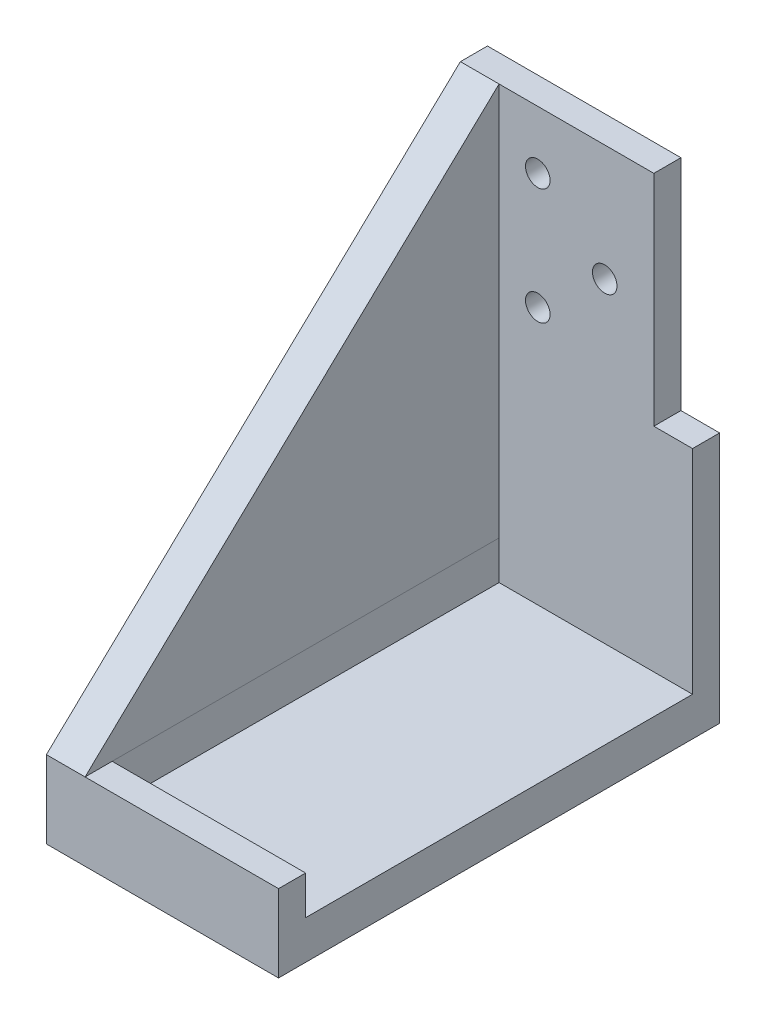
ISO-10303-21;
HEADER;
FILE_DESCRIPTION(('STEP AP214'),'2;1');
FILE_NAME('part.step','',(''),(''),'','','');
FILE_SCHEMA(('AUTOMOTIVE_DESIGN { 1 0 10303 214 1 1 1 1 }'));
ENDSEC;
DATA;
#1=APPLICATION_CONTEXT('core data for automotive mechanical design processes');
#2=APPLICATION_PROTOCOL_DEFINITION('international standard','automotive_design',2000,#1);
#3=PRODUCT_CONTEXT('',#1,'mechanical');
#4=PRODUCT('Part','Part','',(#3));
#5=PRODUCT_RELATED_PRODUCT_CATEGORY('part','',(#4));
#6=PRODUCT_DEFINITION_FORMATION('','',#4);
#7=PRODUCT_DEFINITION_CONTEXT('part definition',#1,'design');
#8=PRODUCT_DEFINITION('design','',#6,#7);
#9=PRODUCT_DEFINITION_SHAPE('','',#8);
#10=(LENGTH_UNIT() NAMED_UNIT(*) SI_UNIT(.MILLI.,.METRE.));
#11=(NAMED_UNIT(*) PLANE_ANGLE_UNIT() SI_UNIT($,.RADIAN.));
#12=(NAMED_UNIT(*) SI_UNIT($,.STERADIAN.) SOLID_ANGLE_UNIT());
#13=UNCERTAINTY_MEASURE_WITH_UNIT(LENGTH_MEASURE(1.E-05),#10,'distance_accuracy_value','');
#14=(GEOMETRIC_REPRESENTATION_CONTEXT(3) GLOBAL_UNCERTAINTY_ASSIGNED_CONTEXT((#13)) GLOBAL_UNIT_ASSIGNED_CONTEXT((#10,
#11,#12)) REPRESENTATION_CONTEXT('',''));
#15=CARTESIAN_POINT('',(0.,0.,0.));
#16=DIRECTION('',(0.,0.,1.));
#17=DIRECTION('',(1.,0.,0.));
#18=AXIS2_PLACEMENT_3D('',#15,#16,#17);
#19=CARTESIAN_POINT('',(30.,177.006953242156,-50.));
#20=DIRECTION('',(0.,0.,-1.));
#21=DIRECTION('',(-1.,0.,0.));
#22=AXIS2_PLACEMENT_3D('',#19,#20,#21);
#23=PLANE('',#22);
#24=CARTESIAN_POINT('',(-10.,96.5999999999998,-50.));
#25=DIRECTION('',(0.,0.,1.));
#26=DIRECTION('',(1.,0.,0.));
#27=AXIS2_PLACEMENT_3D('',#24,#25,#26);
#28=CIRCLE('',#27,3.175);
#29=CARTESIAN_POINT('',(-6.82500000000001,96.5999999999998,-50.));
#30=VERTEX_POINT('',#29);
#31=EDGE_CURVE('E238',#30,#30,#28,.T.);
#32=ORIENTED_EDGE('',*,*,#31,.F.);
#33=EDGE_LOOP('',(#32));
#34=FACE_BOUND('',#33,.T.);
#35=CARTESIAN_POINT('',(7.30000000000001,81.5999999999998,-50.));
#36=DIRECTION('',(0.,0.,1.));
#37=DIRECTION('',(1.,0.,0.));
#38=AXIS2_PLACEMENT_3D('',#35,#36,#37);
#39=CIRCLE('',#38,3.175);
#40=CARTESIAN_POINT('',(10.475,81.5999999999998,-50.));
#41=VERTEX_POINT('',#40);
#42=EDGE_CURVE('E458',#41,#41,#39,.T.);
#43=ORIENTED_EDGE('',*,*,#42,.F.);
#44=EDGE_LOOP('',(#43));
#45=FACE_BOUND('',#44,.T.);
#46=CARTESIAN_POINT('',(-10.,66.5999999999998,-50.));
#47=DIRECTION('',(0.,0.,1.));
#48=DIRECTION('',(1.,0.,0.));
#49=AXIS2_PLACEMENT_3D('',#46,#47,#48);
#50=CIRCLE('',#49,3.175);
#51=CARTESIAN_POINT('',(-6.82500000000001,66.5999999999998,-50.));
#52=VERTEX_POINT('',#51);
#53=EDGE_CURVE('E241',#52,#52,#50,.T.);
#54=ORIENTED_EDGE('',*,*,#53,.F.);
#55=EDGE_LOOP('',(#54));
#56=FACE_BOUND('',#55,.T.);
#57=DIRECTION('',(0.,-1.,0.));
#58=VECTOR('',#57,1.);
#59=CARTESIAN_POINT('',(30.,177.006953242156,-50.));
#60=LINE('',#59,#58);
#61=CARTESIAN_POINT('',(30.,54.9999999999992,-50.));
#62=VERTEX_POINT('',#61);
#63=CARTESIAN_POINT('',(30.,0.,-50.));
#64=VERTEX_POINT('',#63);
#65=EDGE_CURVE('E198',#62,#64,#60,.T.);
#66=ORIENTED_EDGE('',*,*,#65,.F.);
#67=DIRECTION('',(1.,0.,0.));
#68=VECTOR('',#67,1.);
#69=CARTESIAN_POINT('',(30.,54.9999999999992,-50.));
#70=LINE('',#69,#68);
#71=CARTESIAN_POINT('',(20.,54.9999999999992,-50.));
#72=VERTEX_POINT('',#71);
#73=EDGE_CURVE('E245',#72,#62,#70,.T.);
#74=ORIENTED_EDGE('',*,*,#73,.F.);
#75=DIRECTION('',(0.,1.,0.));
#76=VECTOR('',#75,1.);
#77=CARTESIAN_POINT('',(20.,42.7934443842655,-50.));
#78=LINE('',#77,#76);
#79=CARTESIAN_POINT('',(20.,111.6,-50.));
#80=VERTEX_POINT('',#79);
#81=EDGE_CURVE('E128',#72,#80,#78,.T.);
#82=ORIENTED_EDGE('',*,*,#81,.T.);
#83=DIRECTION('',(-1.,0.,0.));
#84=VECTOR('',#83,1.);
#85=CARTESIAN_POINT('',(30.,111.6,-50.));
#86=LINE('',#85,#84);
#87=CARTESIAN_POINT('',(-20.,111.6,-50.));
#88=VERTEX_POINT('',#87);
#89=EDGE_CURVE('E60',#80,#88,#86,.T.);
#90=ORIENTED_EDGE('',*,*,#89,.T.);
#91=DIRECTION('',(0.,1.,0.));
#92=VECTOR('',#91,1.);
#93=CARTESIAN_POINT('',(-20.,177.006953242156,-50.));
#94=LINE('',#93,#92);
#95=CARTESIAN_POINT('',(-20.,10.,-50.));
#96=VERTEX_POINT('',#95);
#97=EDGE_CURVE('E160',#96,#88,#94,.T.);
#98=ORIENTED_EDGE('',*,*,#97,.F.);
#99=DIRECTION('',(0.,-1.,0.));
#100=VECTOR('',#99,1.);
#101=CARTESIAN_POINT('',(-20.,10.,-50.));
#102=LINE('',#101,#100);
#103=CARTESIAN_POINT('',(-20.,0.,-50.));
#104=VERTEX_POINT('',#103);
#105=EDGE_CURVE('E177',#96,#104,#102,.T.);
#106=ORIENTED_EDGE('',*,*,#105,.T.);
#107=DIRECTION('',(1.,0.,0.));
#108=VECTOR('',#107,1.);
#109=CARTESIAN_POINT('',(30.,0.,-50.));
#110=LINE('',#109,#108);
#111=EDGE_CURVE('E190',#104,#64,#110,.T.);
#112=ORIENTED_EDGE('',*,*,#111,.T.);
#113=EDGE_LOOP('',(#66,#74,#82,#90,#98,#106,#112));
#114=FACE_BOUND('',#113,.T.);
#115=ADVANCED_FACE('F37',(#34,#45,#56,#114),#23,.F.);
#116=CARTESIAN_POINT('',(0.,10.,0.));
#117=DIRECTION('',(0.,-1.,0.));
#118=DIRECTION('',(0.,0.,-1.));
#119=AXIS2_PLACEMENT_3D('',#116,#117,#118);
#120=PLANE('',#119);
#121=DIRECTION('',(0.,0.,-1.));
#122=VECTOR('',#121,1.);
#123=CARTESIAN_POINT('',(-20.,10.,0.));
#124=LINE('',#123,#122);
#125=CARTESIAN_POINT('',(-20.,10.,57.));
#126=VERTEX_POINT('',#125);
#127=CARTESIAN_POINT('',(-20.,10.,50.));
#128=VERTEX_POINT('',#127);
#129=EDGE_CURVE('E11',#126,#128,#124,.T.);
#130=ORIENTED_EDGE('',*,*,#129,.F.);
#131=DIRECTION('',(1.,0.,0.));
#132=VECTOR('',#131,1.);
#133=CARTESIAN_POINT('',(30.,10.,57.));
#134=LINE('',#133,#132);
#135=CARTESIAN_POINT('',(30.,10.,57.));
#136=VERTEX_POINT('',#135);
#137=EDGE_CURVE('E168',#126,#136,#134,.T.);
#138=ORIENTED_EDGE('',*,*,#137,.T.);
#139=DIRECTION('',(0.,0.,-1.));
#140=VECTOR('',#139,1.);
#141=CARTESIAN_POINT('',(30.,10.,49.9999999999999));
#142=LINE('',#141,#140);
#143=CARTESIAN_POINT('',(30.,10.,49.9999999999999));
#144=VERTEX_POINT('',#143);
#145=EDGE_CURVE('E167',#136,#144,#142,.T.);
#146=ORIENTED_EDGE('',*,*,#145,.T.);
#147=DIRECTION('',(-1.,0.,0.));
#148=VECTOR('',#147,1.);
#149=CARTESIAN_POINT('',(-20.103587148534,10.,50.));
#150=LINE('',#149,#148);
#151=EDGE_CURVE('E171',#144,#128,#150,.T.);
#152=ORIENTED_EDGE('',*,*,#151,.T.);
#153=EDGE_LOOP('',(#130,#138,#146,#152));
#154=FACE_BOUND('',#153,.T.);
#155=ADVANCED_FACE('F263',(#154),#120,.F.);
#156=CARTESIAN_POINT('',(0.,0.,0.));
#157=DIRECTION('',(0.,-1.,0.));
#158=DIRECTION('',(0.,0.,-1.));
#159=AXIS2_PLACEMENT_3D('',#156,#157,#158);
#160=PLANE('',#159);
#161=DIRECTION('',(-1.,0.,0.));
#162=VECTOR('',#161,1.);
#163=CARTESIAN_POINT('',(-20.103587148534,0.,50.));
#164=LINE('',#163,#162);
#165=CARTESIAN_POINT('',(30.,0.,50.));
#166=VERTEX_POINT('',#165);
#167=CARTESIAN_POINT('',(-20.103587148534,0.,50.));
#168=VERTEX_POINT('',#167);
#169=EDGE_CURVE('E163',#166,#168,#164,.T.);
#170=ORIENTED_EDGE('',*,*,#169,.F.);
#171=DIRECTION('',(0.,0.,-1.));
#172=VECTOR('',#171,1.);
#173=CARTESIAN_POINT('',(30.,0.,57.));
#174=LINE('',#173,#172);
#175=EDGE_CURVE('E195',#166,#64,#174,.T.);
#176=ORIENTED_EDGE('',*,*,#175,.T.);
#177=ORIENTED_EDGE('',*,*,#111,.F.);
#178=DIRECTION('',(0.00103587092957979,0.,-0.999999463485565));
#179=VECTOR('',#178,1.);
#180=CARTESIAN_POINT('',(-20.,0.,-50.));
#181=LINE('',#180,#179);
#182=EDGE_CURVE('E180',#168,#104,#181,.T.);
#183=ORIENTED_EDGE('',*,*,#182,.F.);
#184=EDGE_LOOP('',(#170,#176,#177,#183));
#185=FACE_BOUND('',#184,.T.);
#186=ADVANCED_FACE('F250',(#185),#160,.F.);
#187=CARTESIAN_POINT('',(30.,-10.,57.));
#188=DIRECTION('',(1.,0.,0.));
#189=DIRECTION('',(0.,0.,-1.));
#190=AXIS2_PLACEMENT_3D('',#187,#188,#189);
#191=PLANE('',#190);
#192=DIRECTION('',(0.,0.,-1.));
#193=VECTOR('',#192,1.);
#194=CARTESIAN_POINT('',(30.,54.9999999999991,-57.));
#195=LINE('',#194,#193);
#196=CARTESIAN_POINT('',(30.,54.9999999999991,-57.));
#197=VERTEX_POINT('',#196);
#198=EDGE_CURVE('E136',#62,#197,#195,.T.);
#199=ORIENTED_EDGE('',*,*,#198,.F.);
#200=ORIENTED_EDGE('',*,*,#65,.T.);
#201=ORIENTED_EDGE('',*,*,#175,.F.);
#202=DIRECTION('',(0.,-1.,0.));
#203=VECTOR('',#202,1.);
#204=CARTESIAN_POINT('',(30.,10.,49.9999999999999));
#205=LINE('',#204,#203);
#206=EDGE_CURVE('E187',#144,#166,#205,.T.);
#207=ORIENTED_EDGE('',*,*,#206,.F.);
#208=ORIENTED_EDGE('',*,*,#145,.F.);
#209=DIRECTION('',(0.,1.,0.));
#210=VECTOR('',#209,1.);
#211=CARTESIAN_POINT('',(30.,-10.,57.));
#212=LINE('',#211,#210);
#213=CARTESIAN_POINT('',(30.,-10.,57.));
#214=VERTEX_POINT('',#213);
#215=EDGE_CURVE('E45',#214,#136,#212,.T.);
#216=ORIENTED_EDGE('',*,*,#215,.F.);
#217=DIRECTION('',(0.,0.,-1.));
#218=VECTOR('',#217,1.);
#219=CARTESIAN_POINT('',(30.,-10.,57.));
#220=LINE('',#219,#218);
#221=CARTESIAN_POINT('',(30.,-10.,-57.));
#222=VERTEX_POINT('',#221);
#223=EDGE_CURVE('E201',#214,#222,#220,.T.);
#224=ORIENTED_EDGE('',*,*,#223,.T.);
#225=DIRECTION('',(0.,1.,0.));
#226=VECTOR('',#225,1.);
#227=CARTESIAN_POINT('',(30.,-10.,-57.));
#228=LINE('',#227,#226);
#229=EDGE_CURVE('E213',#222,#197,#228,.T.);
#230=ORIENTED_EDGE('',*,*,#229,.T.);
#231=EDGE_LOOP('',(#199,#200,#201,#207,#208,#216,#224,#230));
#232=FACE_BOUND('',#231,.T.);
#233=ADVANCED_FACE('F39',(#232),#191,.T.);
#234=CARTESIAN_POINT('',(-30.,-10.,57.));
#235=DIRECTION('',(0.,0.,1.));
#236=DIRECTION('',(1.,0.,0.));
#237=AXIS2_PLACEMENT_3D('',#234,#235,#236);
#238=PLANE('',#237);
#239=ORIENTED_EDGE('',*,*,#215,.T.);
#240=ORIENTED_EDGE('',*,*,#137,.F.);
#241=CARTESIAN_POINT('',(-30.,10.,57.));
#242=VERTEX_POINT('',#241);
#243=EDGE_CURVE('E164',#242,#126,#134,.T.);
#244=ORIENTED_EDGE('',*,*,#243,.F.);
#245=DIRECTION('',(0.,1.,0.));
#246=VECTOR('',#245,1.);
#247=CARTESIAN_POINT('',(-30.,-10.,57.));
#248=LINE('',#247,#246);
#249=CARTESIAN_POINT('',(-30.,-10.,57.));
#250=VERTEX_POINT('',#249);
#251=EDGE_CURVE('E218',#250,#242,#248,.T.);
#252=ORIENTED_EDGE('',*,*,#251,.F.);
#253=DIRECTION('',(1.,0.,0.));
#254=VECTOR('',#253,1.);
#255=CARTESIAN_POINT('',(-30.,-10.,57.));
#256=LINE('',#255,#254);
#257=EDGE_CURVE('E210',#250,#214,#256,.T.);
#258=ORIENTED_EDGE('',*,*,#257,.T.);
#259=EDGE_LOOP('',(#239,#240,#244,#252,#258));
#260=FACE_BOUND('',#259,.T.);
#261=ADVANCED_FACE('F272',(#260),#238,.T.);
#262=CARTESIAN_POINT('',(-30.,-10.,57.));
#263=DIRECTION('',(-1.,0.,0.));
#264=DIRECTION('',(0.,0.,1.));
#265=AXIS2_PLACEMENT_3D('',#262,#263,#264);
#266=PLANE('',#265);
#267=DIRECTION('',(0.,0.688571326100926,-0.725168620992119));
#268=VECTOR('',#267,1.);
#269=CARTESIAN_POINT('',(-30.,10.,57.));
#270=LINE('',#269,#268);
#271=CARTESIAN_POINT('',(-30.,111.6,-50.));
#272=VERTEX_POINT('',#271);
#273=EDGE_CURVE('E152',#242,#272,#270,.T.);
#274=ORIENTED_EDGE('',*,*,#273,.T.);
#275=DIRECTION('',(0.,0.,-1.));
#276=VECTOR('',#275,1.);
#277=CARTESIAN_POINT('',(-30.,111.6,-50.));
#278=LINE('',#277,#276);
#279=CARTESIAN_POINT('',(-30.,111.6,-57.));
#280=VERTEX_POINT('',#279);
#281=EDGE_CURVE('E191',#272,#280,#278,.T.);
#282=ORIENTED_EDGE('',*,*,#281,.T.);
#283=DIRECTION('',(0.,1.,0.));
#284=VECTOR('',#283,1.);
#285=CARTESIAN_POINT('',(-30.,-10.,-57.));
#286=LINE('',#285,#284);
#287=CARTESIAN_POINT('',(-30.,-10.,-57.));
#288=VERTEX_POINT('',#287);
#289=EDGE_CURVE('E221',#288,#280,#286,.T.);
#290=ORIENTED_EDGE('',*,*,#289,.F.);
#291=DIRECTION('',(0.,0.,1.));
#292=VECTOR('',#291,1.);
#293=CARTESIAN_POINT('',(-30.,-10.,57.));
#294=LINE('',#293,#292);
#295=EDGE_CURVE('E207',#288,#250,#294,.T.);
#296=ORIENTED_EDGE('',*,*,#295,.T.);
#297=ORIENTED_EDGE('',*,*,#251,.T.);
#298=EDGE_LOOP('',(#274,#282,#290,#296,#297));
#299=FACE_BOUND('',#298,.T.);
#300=ADVANCED_FACE('F231',(#299),#266,.T.);
#301=CARTESIAN_POINT('',(-30.,-10.,-57.));
#302=DIRECTION('',(0.,0.,-1.));
#303=DIRECTION('',(-1.,0.,0.));
#304=AXIS2_PLACEMENT_3D('',#301,#302,#303);
#305=PLANE('',#304);
#306=CARTESIAN_POINT('',(-10.,96.5999999999998,-57.));
#307=DIRECTION('',(0.,0.,1.));
#308=DIRECTION('',(1.,0.,0.));
#309=AXIS2_PLACEMENT_3D('',#306,#307,#308);
#310=CIRCLE('',#309,3.175);
#311=CARTESIAN_POINT('',(-6.82500000000001,96.5999999999998,-57.));
#312=VERTEX_POINT('',#311);
#313=EDGE_CURVE('E235',#312,#312,#310,.T.);
#314=ORIENTED_EDGE('',*,*,#313,.T.);
#315=EDGE_LOOP('',(#314));
#316=FACE_BOUND('',#315,.T.);
#317=CARTESIAN_POINT('',(7.30000000000001,81.5999999999998,-57.));
#318=DIRECTION('',(0.,0.,1.));
#319=DIRECTION('',(1.,0.,0.));
#320=AXIS2_PLACEMENT_3D('',#317,#318,#319);
#321=CIRCLE('',#320,3.175);
#322=CARTESIAN_POINT('',(10.475,81.5999999999998,-57.));
#323=VERTEX_POINT('',#322);
#324=EDGE_CURVE('E455',#323,#323,#321,.T.);
#325=ORIENTED_EDGE('',*,*,#324,.T.);
#326=EDGE_LOOP('',(#325));
#327=FACE_BOUND('',#326,.T.);
#328=CARTESIAN_POINT('',(-10.,66.5999999999998,-57.));
#329=DIRECTION('',(0.,0.,1.));
#330=DIRECTION('',(1.,0.,0.));
#331=AXIS2_PLACEMENT_3D('',#328,#329,#330);
#332=CIRCLE('',#331,3.175);
#333=CARTESIAN_POINT('',(-6.82500000000001,66.5999999999998,-57.));
#334=VERTEX_POINT('',#333);
#335=EDGE_CURVE('E462',#334,#334,#332,.T.);
#336=ORIENTED_EDGE('',*,*,#335,.T.);
#337=EDGE_LOOP('',(#336));
#338=FACE_BOUND('',#337,.T.);
#339=DIRECTION('',(-1.,0.,0.));
#340=VECTOR('',#339,1.);
#341=CARTESIAN_POINT('',(30.,54.9999999999991,-57.));
#342=LINE('',#341,#340);
#343=CARTESIAN_POINT('',(20.,54.9999999999991,-57.));
#344=VERTEX_POINT('',#343);
#345=EDGE_CURVE('E133',#197,#344,#342,.T.);
#346=ORIENTED_EDGE('',*,*,#345,.F.);
#347=ORIENTED_EDGE('',*,*,#229,.F.);
#348=DIRECTION('',(-1.,0.,0.));
#349=VECTOR('',#348,1.);
#350=CARTESIAN_POINT('',(-30.,-10.,-57.));
#351=LINE('',#350,#349);
#352=EDGE_CURVE('E204',#222,#288,#351,.T.);
#353=ORIENTED_EDGE('',*,*,#352,.T.);
#354=ORIENTED_EDGE('',*,*,#289,.T.);
#355=DIRECTION('',(1.,0.,0.));
#356=VECTOR('',#355,1.);
#357=CARTESIAN_POINT('',(-30.,111.6,-57.));
#358=LINE('',#357,#356);
#359=CARTESIAN_POINT('',(20.,111.6,-57.));
#360=VERTEX_POINT('',#359);
#361=EDGE_CURVE('E144',#280,#360,#358,.T.);
#362=ORIENTED_EDGE('',*,*,#361,.T.);
#363=DIRECTION('',(0.,1.,0.));
#364=VECTOR('',#363,1.);
#365=CARTESIAN_POINT('',(20.,42.7934443842655,-57.));
#366=LINE('',#365,#364);
#367=EDGE_CURVE('E52',#344,#360,#366,.T.);
#368=ORIENTED_EDGE('',*,*,#367,.F.);
#369=EDGE_LOOP('',(#346,#347,#353,#354,#362,#368));
#370=FACE_BOUND('',#369,.T.);
#371=ADVANCED_FACE('F142',(#316,#327,#338,#370),#305,.T.);
#372=CARTESIAN_POINT('',(0.,-10.,0.));
#373=DIRECTION('',(0.,-1.,0.));
#374=DIRECTION('',(0.,0.,-1.));
#375=AXIS2_PLACEMENT_3D('',#372,#373,#374);
#376=PLANE('',#375);
#377=ORIENTED_EDGE('',*,*,#223,.F.);
#378=ORIENTED_EDGE('',*,*,#257,.F.);
#379=ORIENTED_EDGE('',*,*,#295,.F.);
#380=ORIENTED_EDGE('',*,*,#352,.F.);
#381=EDGE_LOOP('',(#377,#378,#379,#380));
#382=FACE_BOUND('',#381,.T.);
#383=ADVANCED_FACE('F228',(#382),#376,.T.);
#384=CARTESIAN_POINT('',(525.983999999993,111.6,-64.9999999999988));
#385=DIRECTION('',(0.,-1.,0.));
#386=DIRECTION('',(1.,0.,0.));
#387=AXIS2_PLACEMENT_3D('',#384,#385,#386);
#388=PLANE('',#387);
#389=ORIENTED_EDGE('',*,*,#89,.F.);
#390=DIRECTION('',(0.,0.,1.));
#391=VECTOR('',#390,1.);
#392=CARTESIAN_POINT('',(20.,111.6,-57.));
#393=LINE('',#392,#391);
#394=EDGE_CURVE('E139',#360,#80,#393,.T.);
#395=ORIENTED_EDGE('',*,*,#394,.F.);
#396=ORIENTED_EDGE('',*,*,#361,.F.);
#397=ORIENTED_EDGE('',*,*,#281,.F.);
#398=DIRECTION('',(-1.,0.,0.));
#399=VECTOR('',#398,1.);
#400=CARTESIAN_POINT('',(-20.,111.6,-50.));
#401=LINE('',#400,#399);
#402=EDGE_CURVE('E155',#88,#272,#401,.T.);
#403=ORIENTED_EDGE('',*,*,#402,.F.);
#404=EDGE_LOOP('',(#389,#395,#396,#397,#403));
#405=FACE_BOUND('',#404,.T.);
#406=ADVANCED_FACE('F234',(#405),#388,.F.);
#407=CARTESIAN_POINT('',(-20.103587148534,10.,50.));
#408=DIRECTION('',(0.,0.,1.));
#409=DIRECTION('',(1.,0.,0.));
#410=AXIS2_PLACEMENT_3D('',#407,#408,#409);
#411=PLANE('',#410);
#412=ORIENTED_EDGE('',*,*,#169,.T.);
#413=DIRECTION('',(0.,-1.,0.));
#414=VECTOR('',#413,1.);
#415=CARTESIAN_POINT('',(-20.103587148534,10.,50.));
#416=LINE('',#415,#414);
#417=CARTESIAN_POINT('',(-20.103587148534,10.,50.));
#418=VERTEX_POINT('',#417);
#419=EDGE_CURVE('E184',#418,#168,#416,.T.);
#420=ORIENTED_EDGE('',*,*,#419,.F.);
#421=EDGE_CURVE('E170',#128,#418,#150,.T.);
#422=ORIENTED_EDGE('',*,*,#421,.F.);
#423=ORIENTED_EDGE('',*,*,#151,.F.);
#424=ORIENTED_EDGE('',*,*,#206,.T.);
#425=EDGE_LOOP('',(#412,#420,#422,#423,#424));
#426=FACE_BOUND('',#425,.T.);
#427=ADVANCED_FACE('F252',(#426),#411,.F.);
#428=CARTESIAN_POINT('',(-20.,10.,-50.));
#429=DIRECTION('',(-0.999999463485565,0.,-0.00103587092957979));
#430=DIRECTION('',(-0.00103587092957979,0.,0.999999463485565));
#431=AXIS2_PLACEMENT_3D('',#428,#429,#430);
#432=PLANE('',#431);
#433=ORIENTED_EDGE('',*,*,#182,.T.);
#434=ORIENTED_EDGE('',*,*,#105,.F.);
#435=DIRECTION('',(0.00103587092957979,0.,-0.999999463485565));
#436=VECTOR('',#435,1.);
#437=CARTESIAN_POINT('',(-20.,10.,-50.));
#438=LINE('',#437,#436);
#439=EDGE_CURVE('E174',#418,#96,#438,.T.);
#440=ORIENTED_EDGE('',*,*,#439,.F.);
#441=ORIENTED_EDGE('',*,*,#419,.T.);
#442=EDGE_LOOP('',(#433,#434,#440,#441));
#443=FACE_BOUND('',#442,.T.);
#444=ADVANCED_FACE('F256',(#443),#432,.F.);
#445=CARTESIAN_POINT('',(-20.,9.99999999999999,-57.));
#446=DIRECTION('',(0.,-1.,0.));
#447=DIRECTION('',(0.,0.,-1.));
#448=AXIS2_PLACEMENT_3D('',#445,#446,#447);
#449=PLANE('',#448);
#450=ORIENTED_EDGE('',*,*,#421,.T.);
#451=ORIENTED_EDGE('',*,*,#439,.T.);
#452=DIRECTION('',(0.,0.,1.));
#453=VECTOR('',#452,1.);
#454=CARTESIAN_POINT('',(-20.,9.99999999999999,-57.));
#455=LINE('',#454,#453);
#456=EDGE_CURVE('E148',#96,#128,#455,.T.);
#457=ORIENTED_EDGE('',*,*,#456,.T.);
#458=EDGE_LOOP('',(#450,#451,#457));
#459=FACE_BOUND('',#458,.T.);
#460=ADVANCED_FACE('F261',(#459),#449,.T.);
#461=CARTESIAN_POINT('',(-20.,0.,0.));
#462=DIRECTION('',(-1.,0.,0.));
#463=DIRECTION('',(0.,0.,1.));
#464=AXIS2_PLACEMENT_3D('',#461,#462,#463);
#465=PLANE('',#464);
#466=ORIENTED_EDGE('',*,*,#456,.F.);
#467=ORIENTED_EDGE('',*,*,#97,.T.);
#468=DIRECTION('',(0.,0.688571326100926,-0.725168620992119));
#469=VECTOR('',#468,1.);
#470=CARTESIAN_POINT('',(-20.,10.,57.));
#471=LINE('',#470,#469);
#472=EDGE_CURVE('E151',#126,#88,#471,.T.);
#473=ORIENTED_EDGE('',*,*,#472,.F.);
#474=ORIENTED_EDGE('',*,*,#129,.T.);
#475=EDGE_LOOP('',(#466,#467,#473,#474));
#476=FACE_BOUND('',#475,.T.);
#477=ADVANCED_FACE('F268',(#476),#465,.F.);
#478=CARTESIAN_POINT('',(-20.,10.,57.));
#479=DIRECTION('',(0.,0.725168620992119,0.688571326100926));
#480=DIRECTION('',(0.,-0.688571326100927,0.725168620992119));
#481=AXIS2_PLACEMENT_3D('',#478,#479,#480);
#482=PLANE('',#481);
#483=ORIENTED_EDGE('',*,*,#273,.F.);
#484=ORIENTED_EDGE('',*,*,#243,.T.);
#485=ORIENTED_EDGE('',*,*,#472,.T.);
#486=ORIENTED_EDGE('',*,*,#402,.T.);
#487=EDGE_LOOP('',(#483,#484,#485,#486));
#488=FACE_BOUND('',#487,.T.);
#489=ADVANCED_FACE('F270',(#488),#482,.T.);
#490=CARTESIAN_POINT('',(98.0000000000016,54.9999999999992,-19.0000000000003));
#491=DIRECTION('',(0.,-1.,0.));
#492=DIRECTION('',(-1.,0.,0.));
#493=AXIS2_PLACEMENT_3D('',#490,#491,#492);
#494=PLANE('',#493);
#495=ORIENTED_EDGE('',*,*,#198,.T.);
#496=ORIENTED_EDGE('',*,*,#345,.T.);
#497=DIRECTION('',(0.,0.,1.));
#498=VECTOR('',#497,1.);
#499=CARTESIAN_POINT('',(20.,54.9999999999991,-57.));
#500=LINE('',#499,#498);
#501=EDGE_CURVE('E125',#344,#72,#500,.T.);
#502=ORIENTED_EDGE('',*,*,#501,.T.);
#503=ORIENTED_EDGE('',*,*,#73,.T.);
#504=EDGE_LOOP('',(#495,#496,#502,#503));
#505=FACE_BOUND('',#504,.T.);
#506=ADVANCED_FACE('F134',(#505),#494,.F.);
#507=CARTESIAN_POINT('',(20.,42.7934443842655,-57.));
#508=DIRECTION('',(-1.,0.,0.));
#509=DIRECTION('',(0.,0.,1.));
#510=AXIS2_PLACEMENT_3D('',#507,#508,#509);
#511=PLANE('',#510);
#512=ORIENTED_EDGE('',*,*,#367,.T.);
#513=ORIENTED_EDGE('',*,*,#394,.T.);
#514=ORIENTED_EDGE('',*,*,#81,.F.);
#515=ORIENTED_EDGE('',*,*,#501,.F.);
#516=EDGE_LOOP('',(#512,#513,#514,#515));
#517=FACE_BOUND('',#516,.T.);
#518=ADVANCED_FACE('F127',(#517),#511,.F.);
#519=CARTESIAN_POINT('',(-10.,66.5999999999998,-57.));
#520=DIRECTION('',(0.,0.,1.));
#521=DIRECTION('',(1.,0.,0.));
#522=AXIS2_PLACEMENT_3D('',#519,#520,#521);
#523=CYLINDRICAL_SURFACE('',#522,3.175);
#524=ORIENTED_EDGE('',*,*,#335,.F.);
#525=EDGE_LOOP('',(#524));
#526=FACE_BOUND('',#525,.T.);
#527=ORIENTED_EDGE('',*,*,#53,.T.);
#528=EDGE_LOOP('',(#527));
#529=FACE_BOUND('',#528,.T.);
#530=ADVANCED_FACE('F336',(#526,#529),#523,.F.);
#531=CARTESIAN_POINT('',(7.30000000000001,81.5999999999998,-57.));
#532=DIRECTION('',(0.,0.,1.));
#533=DIRECTION('',(1.,0.,0.));
#534=AXIS2_PLACEMENT_3D('',#531,#532,#533);
#535=CYLINDRICAL_SURFACE('',#534,3.175);
#536=ORIENTED_EDGE('',*,*,#324,.F.);
#537=EDGE_LOOP('',(#536));
#538=FACE_BOUND('',#537,.T.);
#539=ORIENTED_EDGE('',*,*,#42,.T.);
#540=EDGE_LOOP('',(#539));
#541=FACE_BOUND('',#540,.T.);
#542=ADVANCED_FACE('F361',(#538,#541),#535,.F.);
#543=CARTESIAN_POINT('',(-10.,96.5999999999998,-57.));
#544=DIRECTION('',(0.,0.,1.));
#545=DIRECTION('',(1.,0.,0.));
#546=AXIS2_PLACEMENT_3D('',#543,#544,#545);
#547=CYLINDRICAL_SURFACE('',#546,3.175);
#548=ORIENTED_EDGE('',*,*,#313,.F.);
#549=EDGE_LOOP('',(#548));
#550=FACE_BOUND('',#549,.T.);
#551=ORIENTED_EDGE('',*,*,#31,.T.);
#552=EDGE_LOOP('',(#551));
#553=FACE_BOUND('',#552,.T.);
#554=ADVANCED_FACE('F371',(#550,#553),#547,.F.);
#555=CLOSED_SHELL('',(#115,#155,#186,#233,#261,#300,#371,#383,#406,#427,#444,#460,#477,#489,
#506,#518,#530,#542,#554));
#556=MANIFOLD_SOLID_BREP('B2',#555);
#557=ADVANCED_BREP_SHAPE_REPRESENTATION('',(#18,#556),#14);
#558=SHAPE_DEFINITION_REPRESENTATION(#9,#557);
ENDSEC;
END-ISO-10303-21;
